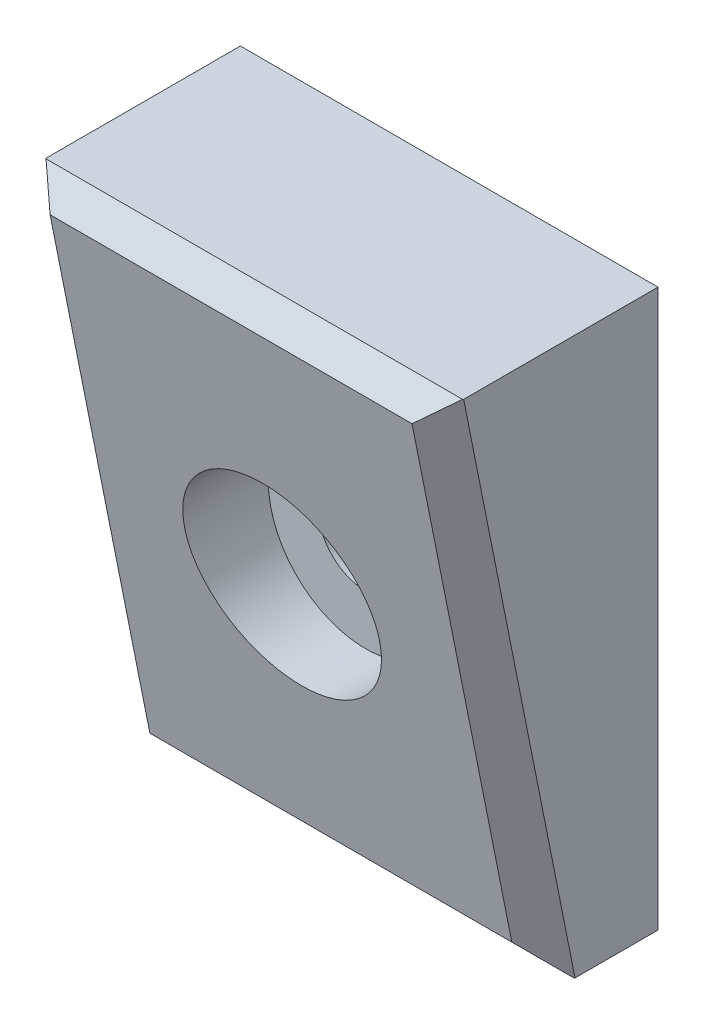
ISO-10303-21;
HEADER;
FILE_DESCRIPTION(('STEP AP214'),'2;1');
FILE_NAME('part.step','',(''),(''),'','','');
FILE_SCHEMA(('AUTOMOTIVE_DESIGN { 1 0 10303 214 1 1 1 1 }'));
ENDSEC;
DATA;
#1=APPLICATION_CONTEXT('core data for automotive mechanical design processes');
#2=APPLICATION_PROTOCOL_DEFINITION('international standard','automotive_design',2000,#1);
#3=PRODUCT_CONTEXT('',#1,'mechanical');
#4=PRODUCT('Part','Part','',(#3));
#5=PRODUCT_RELATED_PRODUCT_CATEGORY('part','',(#4));
#6=PRODUCT_DEFINITION_FORMATION('','',#4);
#7=PRODUCT_DEFINITION_CONTEXT('part definition',#1,'design');
#8=PRODUCT_DEFINITION('design','',#6,#7);
#9=PRODUCT_DEFINITION_SHAPE('','',#8);
#10=(LENGTH_UNIT() NAMED_UNIT(*) SI_UNIT(.MILLI.,.METRE.));
#11=(NAMED_UNIT(*) PLANE_ANGLE_UNIT() SI_UNIT($,.RADIAN.));
#12=(NAMED_UNIT(*) SI_UNIT($,.STERADIAN.) SOLID_ANGLE_UNIT());
#13=UNCERTAINTY_MEASURE_WITH_UNIT(LENGTH_MEASURE(1.E-05),#10,'distance_accuracy_value','');
#14=(GEOMETRIC_REPRESENTATION_CONTEXT(3) GLOBAL_UNCERTAINTY_ASSIGNED_CONTEXT((#13)) GLOBAL_UNIT_ASSIGNED_CONTEXT((#10,
#11,#12)) REPRESENTATION_CONTEXT('',''));
#15=CARTESIAN_POINT('',(0.,0.,0.));
#16=DIRECTION('',(0.,0.,1.));
#17=DIRECTION('',(1.,0.,0.));
#18=AXIS2_PLACEMENT_3D('',#15,#16,#17);
#19=CARTESIAN_POINT('',(0.,0.,8.));
#20=DIRECTION('',(0.,0.,-1.));
#21=DIRECTION('',(-1.,0.,0.));
#22=AXIS2_PLACEMENT_3D('',#19,#20,#21);
#23=CYLINDRICAL_SURFACE('',#22,1.7);
#24=CARTESIAN_POINT('',(0.,0.,0.));
#25=DIRECTION('',(0.,0.,1.));
#26=DIRECTION('',(1.,0.,0.));
#27=AXIS2_PLACEMENT_3D('',#24,#25,#26);
#28=CIRCLE('',#27,1.7);
#29=CARTESIAN_POINT('',(1.7,0.,0.));
#30=VERTEX_POINT('',#29);
#31=EDGE_CURVE('E128',#30,#30,#28,.T.);
#32=ORIENTED_EDGE('',*,*,#31,.F.);
#33=EDGE_LOOP('',(#32));
#34=FACE_BOUND('',#33,.T.);
#35=CARTESIAN_POINT('',(0.,0.,3.));
#36=DIRECTION('',(0.,0.,1.));
#37=DIRECTION('',(1.,0.,0.));
#38=AXIS2_PLACEMENT_3D('',#35,#36,#37);
#39=CIRCLE('',#38,1.7);
#40=CARTESIAN_POINT('',(1.7,0.,3.));
#41=VERTEX_POINT('',#40);
#42=EDGE_CURVE('E131',#41,#41,#39,.T.);
#43=ORIENTED_EDGE('',*,*,#42,.T.);
#44=EDGE_LOOP('',(#43));
#45=FACE_BOUND('',#44,.T.);
#46=ADVANCED_FACE('F39',(#34,#45),#23,.F.);
#47=CARTESIAN_POINT('',(0.,0.,0.));
#48=DIRECTION('',(0.,0.,1.));
#49=DIRECTION('',(1.,0.,0.));
#50=AXIS2_PLACEMENT_3D('',#47,#48,#49);
#51=PLANE('',#50);
#52=DIRECTION('',(0.,-1.,0.));
#53=VECTOR('',#52,1.);
#54=CARTESIAN_POINT('',(-7.5,-10.,0.));
#55=LINE('',#54,#53);
#56=CARTESIAN_POINT('',(-7.5,9.99999999999999,0.));
#57=VERTEX_POINT('',#56);
#58=CARTESIAN_POINT('',(-7.5,-10.,0.));
#59=VERTEX_POINT('',#58);
#60=EDGE_CURVE('E120',#57,#59,#55,.T.);
#61=ORIENTED_EDGE('',*,*,#60,.F.);
#62=DIRECTION('',(-1.,0.,0.));
#63=VECTOR('',#62,1.);
#64=CARTESIAN_POINT('',(7.5,10.,0.));
#65=LINE('',#64,#63);
#66=CARTESIAN_POINT('',(7.5,10.,0.));
#67=VERTEX_POINT('',#66);
#68=EDGE_CURVE('E136',#67,#57,#65,.T.);
#69=ORIENTED_EDGE('',*,*,#68,.F.);
#70=DIRECTION('',(0.,1.,0.));
#71=VECTOR('',#70,1.);
#72=CARTESIAN_POINT('',(7.5,-10.,0.));
#73=LINE('',#72,#71);
#74=CARTESIAN_POINT('',(7.5,-10.,0.));
#75=VERTEX_POINT('',#74);
#76=EDGE_CURVE('E122',#75,#67,#73,.T.);
#77=ORIENTED_EDGE('',*,*,#76,.F.);
#78=DIRECTION('',(1.,0.,0.));
#79=VECTOR('',#78,1.);
#80=CARTESIAN_POINT('',(7.5,-10.,0.));
#81=LINE('',#80,#79);
#82=EDGE_CURVE('E106',#59,#75,#81,.T.);
#83=ORIENTED_EDGE('',*,*,#82,.F.);
#84=EDGE_LOOP('',(#61,#69,#77,#83));
#85=FACE_BOUND('',#84,.T.);
#86=ORIENTED_EDGE('',*,*,#31,.T.);
#87=EDGE_LOOP('',(#86));
#88=FACE_BOUND('',#87,.T.);
#89=ADVANCED_FACE('F117',(#85,#88),#51,.F.);
#90=CARTESIAN_POINT('',(-7.5,-10.,8.));
#91=DIRECTION('',(1.,0.,0.));
#92=DIRECTION('',(0.,0.,-1.));
#93=AXIS2_PLACEMENT_3D('',#90,#91,#92);
#94=PLANE('',#93);
#95=DIRECTION('',(0.,0.,-1.));
#96=VECTOR('',#95,1.);
#97=CARTESIAN_POINT('',(-7.5,-10.,8.));
#98=LINE('',#97,#96);
#99=CARTESIAN_POINT('',(-7.5,-10.,2.98019609728143));
#100=VERTEX_POINT('',#99);
#101=EDGE_CURVE('E103',#100,#59,#98,.T.);
#102=ORIENTED_EDGE('',*,*,#101,.F.);
#103=DIRECTION('',(0.,0.98058067569092,0.196116135138184));
#104=VECTOR('',#103,1.);
#105=CARTESIAN_POINT('',(-7.5,-9.03465309563105,3.17326547815522));
#106=LINE('',#105,#104);
#107=CARTESIAN_POINT('',(-7.5,9.99999999999999,6.98019609728143));
#108=VERTEX_POINT('',#107);
#109=EDGE_CURVE('E163',#100,#108,#106,.T.);
#110=ORIENTED_EDGE('',*,*,#109,.T.);
#111=DIRECTION('',(0.,0.,-1.));
#112=VECTOR('',#111,1.);
#113=CARTESIAN_POINT('',(-7.5,9.99999999999999,8.));
#114=LINE('',#113,#112);
#115=EDGE_CURVE('E126',#108,#57,#114,.T.);
#116=ORIENTED_EDGE('',*,*,#115,.T.);
#117=ORIENTED_EDGE('',*,*,#60,.T.);
#118=EDGE_LOOP('',(#102,#110,#116,#117));
#119=FACE_BOUND('',#118,.T.);
#120=ADVANCED_FACE('F124',(#119),#94,.F.);
#121=CARTESIAN_POINT('',(7.5,-10.,8.));
#122=DIRECTION('',(0.,1.,0.));
#123=DIRECTION('',(0.,0.,1.));
#124=AXIS2_PLACEMENT_3D('',#121,#122,#123);
#125=PLANE('',#124);
#126=DIRECTION('',(-1.,0.,0.));
#127=VECTOR('',#126,1.);
#128=CARTESIAN_POINT('',(7.5,-10.,2.99999999999999));
#129=LINE('',#128,#127);
#130=CARTESIAN_POINT('',(7.48058067569092,-10.,2.99999999999999));
#131=VERTEX_POINT('',#130);
#132=CARTESIAN_POINT('',(-7.48058067569092,-10.,2.99999999999999));
#133=VERTEX_POINT('',#132);
#134=EDGE_CURVE('E56',#131,#133,#129,.T.);
#135=ORIENTED_EDGE('',*,*,#134,.T.);
#136=DIRECTION('',(0.700140042014006,0.,0.714005547295416));
#137=VECTOR('',#136,1.);
#138=CARTESIAN_POINT('',(-7.40348386857326,-10.,3.07862362478572));
#139=LINE('',#138,#137);
#140=EDGE_CURVE('E48',#133,#100,#139,.F.);
#141=ORIENTED_EDGE('',*,*,#140,.T.);
#142=ORIENTED_EDGE('',*,*,#101,.T.);
#143=ORIENTED_EDGE('',*,*,#82,.T.);
#144=DIRECTION('',(0.,0.,-1.));
#145=VECTOR('',#144,1.);
#146=CARTESIAN_POINT('',(7.5,-10.,8.));
#147=LINE('',#146,#145);
#148=CARTESIAN_POINT('',(7.5,-10.,2.98019609728144));
#149=VERTEX_POINT('',#148);
#150=EDGE_CURVE('E113',#149,#75,#147,.T.);
#151=ORIENTED_EDGE('',*,*,#150,.F.);
#152=DIRECTION('',(0.700140042014003,0.,-0.714005547295418));
#153=VECTOR('',#152,1.);
#154=CARTESIAN_POINT('',(4.50038450447342,-10.,6.03921568627452));
#155=LINE('',#154,#153);
#156=EDGE_CURVE('E61',#149,#131,#155,.F.);
#157=ORIENTED_EDGE('',*,*,#156,.T.);
#158=EDGE_LOOP('',(#135,#141,#142,#143,#151,#157));
#159=FACE_BOUND('',#158,.T.);
#160=ADVANCED_FACE('F105',(#159),#125,.F.);
#161=CARTESIAN_POINT('',(7.5,-10.,8.));
#162=DIRECTION('',(-1.,0.,0.));
#163=DIRECTION('',(0.,0.,1.));
#164=AXIS2_PLACEMENT_3D('',#161,#162,#163);
#165=PLANE('',#164);
#166=DIRECTION('',(0.,0.,-1.));
#167=VECTOR('',#166,1.);
#168=CARTESIAN_POINT('',(7.5,10.,8.));
#169=LINE('',#168,#167);
#170=CARTESIAN_POINT('',(7.5,10.,6.98019609728144));
#171=VERTEX_POINT('',#170);
#172=EDGE_CURVE('E139',#171,#67,#169,.T.);
#173=ORIENTED_EDGE('',*,*,#172,.F.);
#174=DIRECTION('',(0.,-0.98058067569092,-0.196116135138184));
#175=VECTOR('',#174,1.);
#176=CARTESIAN_POINT('',(7.5,-9.03465309563106,3.17326547815523));
#177=LINE('',#176,#175);
#178=EDGE_CURVE('E12',#171,#149,#177,.T.);
#179=ORIENTED_EDGE('',*,*,#178,.T.);
#180=ORIENTED_EDGE('',*,*,#150,.T.);
#181=ORIENTED_EDGE('',*,*,#76,.T.);
#182=EDGE_LOOP('',(#173,#179,#180,#181));
#183=FACE_BOUND('',#182,.T.);
#184=ADVANCED_FACE('F193',(#183),#165,.F.);
#185=CARTESIAN_POINT('',(7.5,10.,8.));
#186=DIRECTION('',(0.,-1.,0.));
#187=DIRECTION('',(1.,0.,0.));
#188=AXIS2_PLACEMENT_3D('',#185,#186,#187);
#189=PLANE('',#188);
#190=ORIENTED_EDGE('',*,*,#115,.F.);
#191=DIRECTION('',(-0.700140042014006,0.,-0.714005547295416));
#192=VECTOR('',#191,1.);
#193=CARTESIAN_POINT('',(-9.40309936409985,9.99999999999999,5.03940793851121));
#194=LINE('',#193,#192);
#195=CARTESIAN_POINT('',(-7.48058067569092,9.99999999999999,6.99999999999999));
#196=VERTEX_POINT('',#195);
#197=EDGE_CURVE('E161',#108,#196,#194,.F.);
#198=ORIENTED_EDGE('',*,*,#197,.T.);
#199=DIRECTION('',(1.,0.,0.));
#200=VECTOR('',#199,1.);
#201=CARTESIAN_POINT('',(7.5,10.,6.99999999999999));
#202=LINE('',#201,#200);
#203=CARTESIAN_POINT('',(7.48058067569092,10.,6.99999999999999));
#204=VERTEX_POINT('',#203);
#205=EDGE_CURVE('E158',#196,#204,#202,.T.);
#206=ORIENTED_EDGE('',*,*,#205,.T.);
#207=DIRECTION('',(-0.700140042014003,0.,0.714005547295418));
#208=VECTOR('',#207,1.);
#209=CARTESIAN_POINT('',(6.5,10.,8.));
#210=LINE('',#209,#208);
#211=EDGE_CURVE('E156',#204,#171,#210,.F.);
#212=ORIENTED_EDGE('',*,*,#211,.T.);
#213=ORIENTED_EDGE('',*,*,#172,.T.);
#214=ORIENTED_EDGE('',*,*,#68,.T.);
#215=EDGE_LOOP('',(#190,#198,#206,#212,#213,#214));
#216=FACE_BOUND('',#215,.T.);
#217=ADVANCED_FACE('F188',(#216),#189,.F.);
#218=CARTESIAN_POINT('',(0.,0.,-9.89949493661167));
#219=DIRECTION('',(0.,0.,1.));
#220=DIRECTION('',(1.,0.,0.));
#221=AXIS2_PLACEMENT_3D('',#218,#219,#220);
#222=CYLINDRICAL_SURFACE('',#221,3.5);
#223=CARTESIAN_POINT('',(0.,0.,6.));
#224=DIRECTION('',(0.,0.196116135138184,-0.98058067569092));
#225=DIRECTION('',(0.,0.98058067569092,0.196116135138184));
#226=AXIS2_PLACEMENT_3D('',#223,#224,#225);
#227=ELLIPSE('',#226,3.56931365951495,3.5);
#228=CARTESIAN_POINT('',(0.,3.5,6.7));
#229=VERTEX_POINT('',#228);
#230=EDGE_CURVE('E145',#229,#229,#227,.F.);
#231=ORIENTED_EDGE('',*,*,#230,.T.);
#232=EDGE_LOOP('',(#231));
#233=FACE_BOUND('',#232,.T.);
#234=CARTESIAN_POINT('',(0.,0.,3.));
#235=DIRECTION('',(0.,0.,1.));
#236=DIRECTION('',(1.,0.,0.));
#237=AXIS2_PLACEMENT_3D('',#234,#235,#236);
#238=CIRCLE('',#237,3.5);
#239=CARTESIAN_POINT('',(3.5,0.,3.));
#240=VERTEX_POINT('',#239);
#241=EDGE_CURVE('E144',#240,#240,#238,.F.);
#242=ORIENTED_EDGE('',*,*,#241,.T.);
#243=EDGE_LOOP('',(#242));
#244=FACE_BOUND('',#243,.T.);
#245=ADVANCED_FACE('F205',(#233,#244),#222,.F.);
#246=CARTESIAN_POINT('',(0.,0.,3.));
#247=DIRECTION('',(0.,0.,1.));
#248=DIRECTION('',(1.,0.,0.));
#249=AXIS2_PLACEMENT_3D('',#246,#247,#248);
#250=PLANE('',#249);
#251=ORIENTED_EDGE('',*,*,#42,.F.);
#252=EDGE_LOOP('',(#251));
#253=FACE_BOUND('',#252,.T.);
#254=ORIENTED_EDGE('',*,*,#241,.F.);
#255=EDGE_LOOP('',(#254));
#256=FACE_BOUND('',#255,.T.);
#257=ADVANCED_FACE('F201',(#253,#256),#250,.T.);
#258=CARTESIAN_POINT('',(-7.5,10.,8.));
#259=DIRECTION('',(0.,0.196116135138184,-0.98058067569092));
#260=DIRECTION('',(0.,0.98058067569092,0.196116135138184));
#261=AXIS2_PLACEMENT_3D('',#258,#259,#260);
#262=PLANE('',#261);
#263=DIRECTION('',(0.,0.98058067569092,0.196116135138184));
#264=VECTOR('',#263,1.);
#265=CARTESIAN_POINT('',(6.5,10.,8.));
#266=LINE('',#265,#264);
#267=CARTESIAN_POINT('',(6.5,-8.75,4.25));
#268=VERTEX_POINT('',#267);
#269=CARTESIAN_POINT('',(6.5,9.16666666666667,7.83333333333333));
#270=VERTEX_POINT('',#269);
#271=EDGE_CURVE('E112',#268,#270,#266,.T.);
#272=ORIENTED_EDGE('',*,*,#271,.T.);
#273=DIRECTION('',(-1.,0.,0.));
#274=VECTOR('',#273,1.);
#275=CARTESIAN_POINT('',(-7.5,9.16666666666666,7.83333333333333));
#276=LINE('',#275,#274);
#277=CARTESIAN_POINT('',(-6.49999999999999,9.16666666666666,7.83333333333333));
#278=VERTEX_POINT('',#277);
#279=EDGE_CURVE('E153',#270,#278,#276,.T.);
#280=ORIENTED_EDGE('',*,*,#279,.T.);
#281=DIRECTION('',(0.,-0.98058067569092,-0.196116135138184));
#282=VECTOR('',#281,1.);
#283=CARTESIAN_POINT('',(-6.49999999999999,10.,8.));
#284=LINE('',#283,#282);
#285=CARTESIAN_POINT('',(-6.49999999999999,-8.75,4.25));
#286=VERTEX_POINT('',#285);
#287=EDGE_CURVE('E151',#278,#286,#284,.T.);
#288=ORIENTED_EDGE('',*,*,#287,.T.);
#289=DIRECTION('',(1.,0.,0.));
#290=VECTOR('',#289,1.);
#291=CARTESIAN_POINT('',(-7.5,-8.75,4.25));
#292=LINE('',#291,#290);
#293=EDGE_CURVE('E149',#286,#268,#292,.T.);
#294=ORIENTED_EDGE('',*,*,#293,.T.);
#295=EDGE_LOOP('',(#272,#280,#288,#294));
#296=FACE_BOUND('',#295,.T.);
#297=ORIENTED_EDGE('',*,*,#230,.F.);
#298=EDGE_LOOP('',(#297));
#299=FACE_BOUND('',#298,.T.);
#300=ADVANCED_FACE('F198',(#296,#299),#262,.F.);
#301=CARTESIAN_POINT('',(-7.5,-8.75,4.25));
#302=DIRECTION('',(0.,0.707106781186549,-0.707106781186546));
#303=DIRECTION('',(1.,0.,0.));
#304=AXIS2_PLACEMENT_3D('',#301,#302,#303);
#305=PLANE('',#304);
#306=DIRECTION('',(-0.485071250072668,-0.61834694240084,-0.618346942400843));
#307=VECTOR('',#306,1.);
#308=CARTESIAN_POINT('',(-6.73529411764705,-9.049942324329,3.95005767567101));
#309=LINE('',#308,#307);
#310=EDGE_CURVE('E171',#133,#286,#309,.F.);
#311=ORIENTED_EDGE('',*,*,#310,.F.);
#312=ORIENTED_EDGE('',*,*,#134,.F.);
#313=DIRECTION('',(0.485071250072665,-0.618346942400841,-0.618346942400844));
#314=VECTOR('',#313,1.);
#315=CARTESIAN_POINT('',(-0.248702297402204,-0.147058823529445,12.8529411764706));
#316=LINE('',#315,#314);
#317=EDGE_CURVE('E43',#268,#131,#316,.T.);
#318=ORIENTED_EDGE('',*,*,#317,.F.);
#319=ORIENTED_EDGE('',*,*,#293,.F.);
#320=EDGE_LOOP('',(#311,#312,#318,#319));
#321=FACE_BOUND('',#320,.T.);
#322=ADVANCED_FACE('F41',(#321),#305,.F.);
#323=CARTESIAN_POINT('',(6.5,10.,8.));
#324=DIRECTION('',(-0.707106781186549,0.138675049056307,-0.693375245281535));
#325=DIRECTION('',(0.,0.98058067569092,0.196116135138184));
#326=AXIS2_PLACEMENT_3D('',#323,#324,#325);
#327=PLANE('',#326);
#328=ORIENTED_EDGE('',*,*,#178,.F.);
#329=ORIENTED_EDGE('',*,*,#211,.F.);
#330=DIRECTION('',(-0.63960214906683,-0.543557306504609,0.543557306504611));
#331=VECTOR('',#330,1.);
#332=CARTESIAN_POINT('',(6.73177361425422,9.36363636363636,7.63636363636363));
#333=LINE('',#332,#331);
#334=EDGE_CURVE('E170',#270,#204,#333,.F.);
#335=ORIENTED_EDGE('',*,*,#334,.F.);
#336=ORIENTED_EDGE('',*,*,#271,.F.);
#337=ORIENTED_EDGE('',*,*,#317,.T.);
#338=ORIENTED_EDGE('',*,*,#156,.F.);
#339=EDGE_LOOP('',(#328,#329,#335,#336,#337,#338));
#340=FACE_BOUND('',#339,.T.);
#341=ADVANCED_FACE('F180',(#340),#327,.F.);
#342=CARTESIAN_POINT('',(-7.5,-9.03465309563106,3.17326547815523));
#343=DIRECTION('',(0.707106781186547,0.138675049056307,-0.693375245281537));
#344=DIRECTION('',(0.,0.98058067569092,0.196116135138184));
#345=AXIS2_PLACEMENT_3D('',#342,#343,#344);
#346=PLANE('',#345);
#347=ORIENTED_EDGE('',*,*,#310,.T.);
#348=ORIENTED_EDGE('',*,*,#287,.F.);
#349=DIRECTION('',(-0.639602149066833,0.543557306504607,-0.543557306504609));
#350=VECTOR('',#349,1.);
#351=CARTESIAN_POINT('',(-2.20133356503103,5.5135026609445,11.4864973390555));
#352=LINE('',#351,#350);
#353=EDGE_CURVE('E168',#196,#278,#352,.F.);
#354=ORIENTED_EDGE('',*,*,#353,.F.);
#355=ORIENTED_EDGE('',*,*,#197,.F.);
#356=ORIENTED_EDGE('',*,*,#109,.F.);
#357=ORIENTED_EDGE('',*,*,#140,.F.);
#358=EDGE_LOOP('',(#347,#348,#354,#355,#356,#357));
#359=FACE_BOUND('',#358,.T.);
#360=ADVANCED_FACE('F184',(#359),#346,.F.);
#361=CARTESIAN_POINT('',(-7.5,9.16666666666666,7.83333333333333));
#362=DIRECTION('',(0.,-0.707106781186549,-0.707106781186547));
#363=DIRECTION('',(-1.,0.,0.));
#364=AXIS2_PLACEMENT_3D('',#361,#362,#363);
#365=PLANE('',#364);
#366=ORIENTED_EDGE('',*,*,#334,.T.);
#367=ORIENTED_EDGE('',*,*,#205,.F.);
#368=ORIENTED_EDGE('',*,*,#353,.T.);
#369=ORIENTED_EDGE('',*,*,#279,.F.);
#370=EDGE_LOOP('',(#366,#367,#368,#369));
#371=FACE_BOUND('',#370,.T.);
#372=ADVANCED_FACE('F196',(#371),#365,.F.);
#373=CLOSED_SHELL('',(#46,#89,#120,#160,#184,#217,#245,#257,#300,#322,#341,#360,#372));
#374=MANIFOLD_SOLID_BREP('B2',#373);
#375=ADVANCED_BREP_SHAPE_REPRESENTATION('',(#18,#374),#14);
#376=SHAPE_DEFINITION_REPRESENTATION(#9,#375);
ENDSEC;
END-ISO-10303-21;
